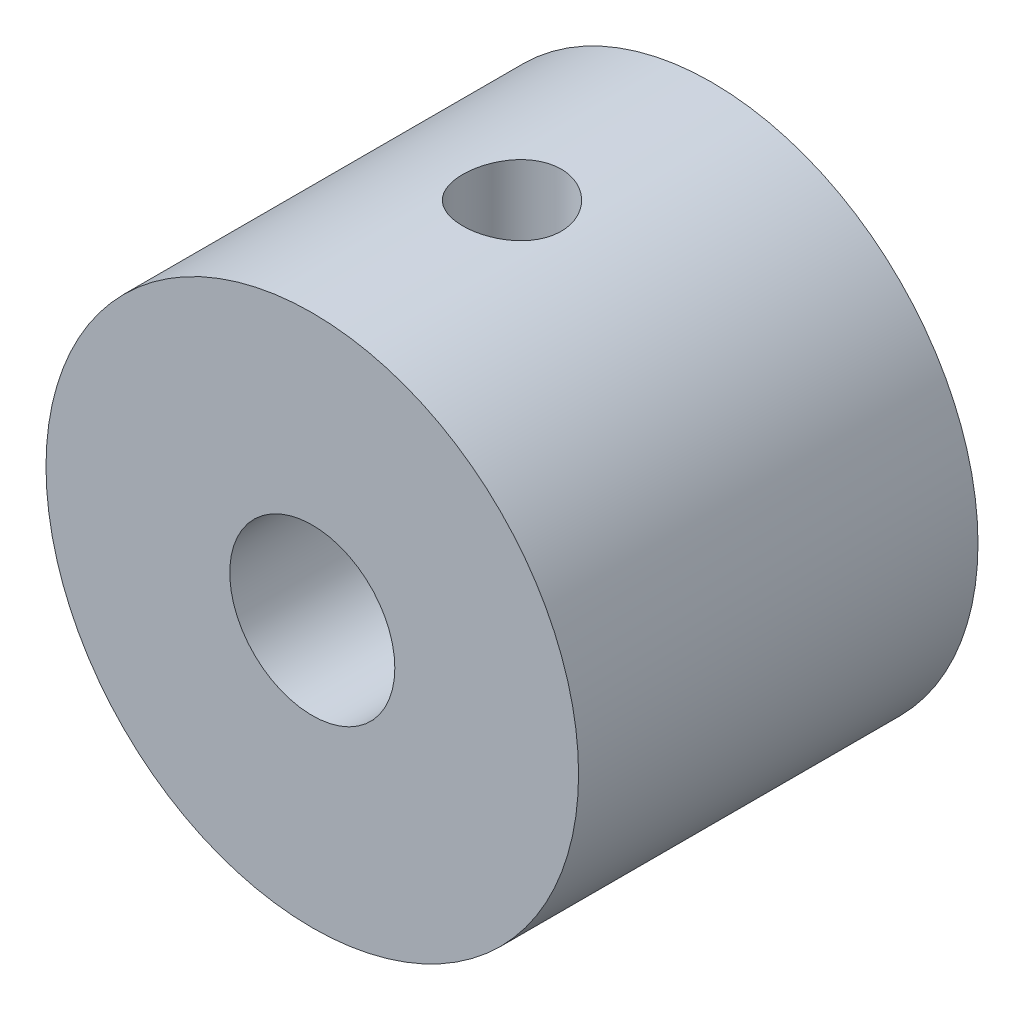
ISO-10303-21;
HEADER;
FILE_DESCRIPTION(('STEP AP214'),'2;1');
FILE_NAME('part.step','',(''),(''),'','','');
FILE_SCHEMA(('AUTOMOTIVE_DESIGN { 1 0 10303 214 1 1 1 1 }'));
ENDSEC;
DATA;
#1=APPLICATION_CONTEXT('core data for automotive mechanical design processes');
#2=APPLICATION_PROTOCOL_DEFINITION('international standard','automotive_design',2000,#1);
#3=PRODUCT_CONTEXT('',#1,'mechanical');
#4=PRODUCT('Part','Part','',(#3));
#5=PRODUCT_RELATED_PRODUCT_CATEGORY('part','',(#4));
#6=PRODUCT_DEFINITION_FORMATION('','',#4);
#7=PRODUCT_DEFINITION_CONTEXT('part definition',#1,'design');
#8=PRODUCT_DEFINITION('design','',#6,#7);
#9=PRODUCT_DEFINITION_SHAPE('','',#8);
#10=(LENGTH_UNIT() NAMED_UNIT(*) SI_UNIT(.MILLI.,.METRE.));
#11=(NAMED_UNIT(*) PLANE_ANGLE_UNIT() SI_UNIT($,.RADIAN.));
#12=(NAMED_UNIT(*) SI_UNIT($,.STERADIAN.) SOLID_ANGLE_UNIT());
#13=UNCERTAINTY_MEASURE_WITH_UNIT(LENGTH_MEASURE(1.E-05),#10,'distance_accuracy_value','');
#14=(GEOMETRIC_REPRESENTATION_CONTEXT(3) GLOBAL_UNCERTAINTY_ASSIGNED_CONTEXT((#13)) GLOBAL_UNIT_ASSIGNED_CONTEXT((#10,
#11,#12)) REPRESENTATION_CONTEXT('',''));
#15=CARTESIAN_POINT('',(0.,0.,0.));
#16=DIRECTION('',(0.,0.,1.));
#17=DIRECTION('',(1.,0.,0.));
#18=AXIS2_PLACEMENT_3D('',#15,#16,#17);
#19=CARTESIAN_POINT('',(0.,0.,15.));
#20=DIRECTION('',(0.,0.,-1.));
#21=DIRECTION('',(-1.,0.,0.));
#22=AXIS2_PLACEMENT_3D('',#19,#20,#21);
#23=CYLINDRICAL_SURFACE('',#22,10.);
#24=CARTESIAN_POINT('',(0.,0.,15.));
#25=DIRECTION('',(0.,0.,1.));
#26=DIRECTION('',(1.,0.,0.));
#27=AXIS2_PLACEMENT_3D('',#24,#25,#26);
#28=CIRCLE('',#27,10.);
#29=CARTESIAN_POINT('',(10.,0.,15.));
#30=VERTEX_POINT('',#29);
#31=EDGE_CURVE('E10',#30,#30,#28,.T.);
#32=ORIENTED_EDGE('',*,*,#31,.F.);
#33=EDGE_LOOP('',(#32));
#34=FACE_BOUND('',#33,.T.);
#35=CARTESIAN_POINT('',(0.,0.,0.));
#36=DIRECTION('',(0.,0.,1.));
#37=DIRECTION('',(1.,0.,0.));
#38=AXIS2_PLACEMENT_3D('',#35,#36,#37);
#39=CIRCLE('',#38,10.);
#40=CARTESIAN_POINT('',(10.,0.,0.));
#41=VERTEX_POINT('',#40);
#42=EDGE_CURVE('E48',#41,#41,#39,.T.);
#43=ORIENTED_EDGE('',*,*,#42,.T.);
#44=EDGE_LOOP('',(#43));
#45=FACE_BOUND('',#44,.T.);
#46=CARTESIAN_POINT('',(0.,10.,5.65));
#47=CARTESIAN_POINT('',(-0.102973767500942,9.99999814437754,5.65000396121481));
#48=CARTESIAN_POINT('',(-0.205999364269343,9.99839301990697,5.65862656276727));
#49=CARTESIAN_POINT('',(-0.409149073121758,9.99214455274753,5.6928679316607));
#50=CARTESIAN_POINT('',(-0.50927063260964,9.98749861699536,5.71850120517623));
#51=CARTESIAN_POINT('',(-0.703644751235533,9.9756884099556,5.78595358925558));
#52=CARTESIAN_POINT('',(-0.797902461405023,9.96852638674241,5.82775825436111));
#53=CARTESIAN_POINT('',(-0.978056937836697,9.9524667664763,5.92632612568955));
#54=CARTESIAN_POINT('',(-1.06395441486053,9.94356931715758,5.98308805876709));
#55=CARTESIAN_POINT('',(-1.2259618528719,9.92490532017029,6.11066270512453));
#56=CARTESIAN_POINT('',(-1.30196010842263,9.91513065935402,6.1816161012393));
#57=CARTESIAN_POINT('',(-1.44104560809233,9.8958743542123,6.33525691060604));
#58=CARTESIAN_POINT('',(-1.50413193959469,9.88639273063894,6.41794515257958));
#59=CARTESIAN_POINT('',(-1.61606530069743,9.86871722983009,6.59349511960131));
#60=CARTESIAN_POINT('',(-1.66479909447,9.86053381653359,6.68643019175173));
#61=CARTESIAN_POINT('',(-1.74591921489614,9.84649540220802,6.87934506485752));
#62=CARTESIAN_POINT('',(-1.77830691230303,9.84064020594773,6.97932427430306));
#63=CARTESIAN_POINT('',(-1.82545778290237,9.83200272690719,7.18229548977259));
#64=CARTESIAN_POINT('',(-1.8404155272159,9.82918654626154,7.28524082535124));
#65=CARTESIAN_POINT('',(-1.85288575088538,9.82684371680513,7.49221553960635));
#66=CARTESIAN_POINT('',(-1.85039975275888,9.82731678090382,7.59624482288275));
#67=CARTESIAN_POINT('',(-1.82821092133522,9.83146811709433,7.80102740333185));
#68=CARTESIAN_POINT('',(-1.80872899829315,9.83510526128641,7.90180559348345));
#69=CARTESIAN_POINT('',(-1.75344908453896,9.84511037076907,8.09863796129818));
#70=CARTESIAN_POINT('',(-1.71765041717884,9.8514784493096,8.19469194286749));
#71=CARTESIAN_POINT('',(-1.63053617300743,9.86627108014629,8.37999752620021));
#72=CARTESIAN_POINT('',(-1.57913107790427,9.87470744087739,8.46920606285033));
#73=CARTESIAN_POINT('',(-1.46232652064901,9.89267821530506,8.63781450578069));
#74=CARTESIAN_POINT('',(-1.396925674642,9.90221273754124,8.71721344089361));
#75=CARTESIAN_POINT('',(-1.25279346927696,9.92148493237727,8.86522550149164));
#76=CARTESIAN_POINT('',(-1.17387308291761,9.93122347825942,8.93365457434973));
#77=CARTESIAN_POINT('',(-1.00557542730397,9.94967197930221,9.05632940408489));
#78=CARTESIAN_POINT('',(-0.916198058419366,9.95838192466112,9.11057502581129));
#79=CARTESIAN_POINT('',(-0.729333931144301,9.97380873411794,9.20336892107791));
#80=CARTESIAN_POINT('',(-0.631837638028559,9.98052321127934,9.24189841567135));
#81=CARTESIAN_POINT('',(-0.431604995171664,9.99118402094831,9.30198219270653));
#82=CARTESIAN_POINT('',(-0.328869188274448,9.99513063959957,9.32353822990775));
#83=CARTESIAN_POINT('',(-0.122657642369728,9.99977185506567,9.34880785474743));
#84=CARTESIAN_POINT('',(-0.0192138142658465,10.000512422377,9.3527736829452));
#85=CARTESIAN_POINT('',(0.186859006065412,9.99878494252441,9.34342640494946));
#86=CARTESIAN_POINT('',(0.289488036988357,9.99631704866185,9.33011412431003));
#87=CARTESIAN_POINT('',(0.490220565537715,9.9884785460155,9.28679824376799));
#88=CARTESIAN_POINT('',(0.588352470380839,9.98313008197242,9.25692193104006));
#89=CARTESIAN_POINT('',(0.778214499245914,9.97012766508597,9.18146355022493));
#90=CARTESIAN_POINT('',(0.869944197164018,9.9624735589687,9.13588043795592));
#91=CARTESIAN_POINT('',(1.04547686385042,9.94559423372409,9.02974167290665));
#92=CARTESIAN_POINT('',(1.12918481510237,9.93635312280346,8.96903145838443));
#93=CARTESIAN_POINT('',(1.28531533096832,9.91736665587246,8.83457141023935));
#94=CARTESIAN_POINT('',(1.35773687049031,9.90762125416665,8.76082039347843));
#95=CARTESIAN_POINT('',(1.49019431675572,9.88857254624198,8.60123161299329));
#96=CARTESIAN_POINT('',(1.55005829293328,9.87927656985902,8.51525012867531));
#97=CARTESIAN_POINT('',(1.65449350417405,9.86232538613881,8.33430327140737));
#98=CARTESIAN_POINT('',(1.69906529814106,9.85467011884022,8.23933822695344));
#99=CARTESIAN_POINT('',(1.77140545970166,9.84192432437304,8.04356199576822));
#100=CARTESIAN_POINT('',(1.79925347904372,9.83682165944636,7.94278106769098));
#101=CARTESIAN_POINT('',(1.83760191623423,9.82973072940691,7.73786776570897));
#102=CARTESIAN_POINT('',(1.84810423359767,9.82774212327709,7.63373576005164));
#103=CARTESIAN_POINT('',(1.85140090250374,9.82712144275677,7.42679770087844));
#104=CARTESIAN_POINT('',(1.84446637748841,9.82843797661815,7.32399602257586));
#105=CARTESIAN_POINT('',(1.81367886703492,9.83416544699117,7.12105049290644));
#106=CARTESIAN_POINT('',(1.78982597637115,9.83857636616848,7.02090662665415));
#107=CARTESIAN_POINT('',(1.7259919299867,9.84997422761892,6.8262601345229));
#108=CARTESIAN_POINT('',(1.68603938038786,9.85695659901166,6.73174784248798));
#109=CARTESIAN_POINT('',(1.59116952647236,9.87271399612175,6.55072434665442));
#110=CARTESIAN_POINT('',(1.53625120375677,9.88148914382472,6.464213687892));
#111=CARTESIAN_POINT('',(1.41206298216248,9.90000331675751,6.30028957222133));
#112=CARTESIAN_POINT('',(1.34259548779529,9.90975453125654,6.22302716437429));
#113=CARTESIAN_POINT('',(1.19169354725332,9.92903018659891,6.08116514829167));
#114=CARTESIAN_POINT('',(1.11025635498003,9.93855457481935,6.01656845379368));
#115=CARTESIAN_POINT('',(0.936875671031765,9.95640083893824,5.90134599886731));
#116=CARTESIAN_POINT('',(0.844846667740486,9.96471149129604,5.85084712478166));
#117=CARTESIAN_POINT('',(0.653487615587092,9.97908439734253,5.76610773716441));
#118=CARTESIAN_POINT('',(0.554164580374216,9.98514877789685,5.73185183544058));
#119=CARTESIAN_POINT('',(0.378780979650357,9.99309841912857,5.6875871481404));
#120=CARTESIAN_POINT('',(0.303750536406796,9.99567199559553,5.67351586257586));
#121=CARTESIAN_POINT('',(0.152489517722104,9.99912345254983,5.65472093522481));
#122=CARTESIAN_POINT('',(0.0762589714683651,10.0000013742127,5.64999706645513));
#123=CARTESIAN_POINT('',(0.,10.,5.65));
#124=B_SPLINE_CURVE_WITH_KNOTS('',3,(#46,#47,#48,#49,#50,#51,#52,#53,#54,#55,#56,#57,#58,#59,
#60,#61,#62,#63,#64,#65,#66,#67,#68,#69,#70,#71,#72,#73,#74,#75,#76,#77,#78,#79,#80,#81,#82,#83,
#84,#85,#86,#87,#88,#89,#90,#91,#92,#93,#94,#95,#96,#97,#98,#99,#100,#101,#102,#103,#104,#105,
#106,#107,#108,#109,#110,#111,#112,#113,#114,#115,#116,#117,#118,#119,#120,#121,#122,#123),
.UNSPECIFIED.,.T.,.F.,(4,2,2,2,2,2,2,2,2,2,2,2,2,2,2,2,2,2,2,2,2,2,2,2,2,2,2,2,2,2,2,2,2,2,2,2,
2,2,4),(0.,0.308642435930629,0.617548411381326,0.926179084471102,1.23478349575572,
1.54661404003968,1.85846661694502,2.17271744097484,2.48694190813341,2.79762401675779,
3.10827900889141,3.41495532576982,3.7216443615336,4.03012690843585,4.33863997120632,
4.65188362923211,4.96513027197181,5.27875011929625,5.59233753953914,5.90141332238849,
6.21047433803256,6.5171926327777,6.82393132196844,7.13394278856437,7.44398239566323,
7.75802378080552,8.07205368703477,8.38457582329753,8.69706373322266,9.00472294455467,
9.31238043243524,9.61949366327707,9.9266277979449,10.2382405227517,10.5499248499334,
10.8643301190917,11.1784369303575,11.4070128759631,11.6355832709944),.UNSPECIFIED.);
#125=CARTESIAN_POINT('',(0.,10.,5.65));
#126=VERTEX_POINT('',#125);
#127=EDGE_CURVE('E58',#126,#126,#124,.T.);
#128=ORIENTED_EDGE('',*,*,#127,.F.);
#129=EDGE_LOOP('',(#128));
#130=FACE_BOUND('',#129,.T.);
#131=ADVANCED_FACE('F35',(#34,#45,#130),#23,.T.);
#132=CARTESIAN_POINT('',(0.,0.,15.));
#133=DIRECTION('',(0.,0.,-1.));
#134=DIRECTION('',(-1.,0.,0.));
#135=AXIS2_PLACEMENT_3D('',#132,#133,#134);
#136=CYLINDRICAL_SURFACE('',#135,3.1);
#137=CARTESIAN_POINT('',(0.,0.,0.));
#138=DIRECTION('',(0.,0.,1.));
#139=DIRECTION('',(1.,0.,0.));
#140=AXIS2_PLACEMENT_3D('',#137,#138,#139);
#141=CIRCLE('',#140,3.1);
#142=CARTESIAN_POINT('',(3.1,0.,0.));
#143=VERTEX_POINT('',#142);
#144=EDGE_CURVE('E55',#143,#143,#141,.T.);
#145=ORIENTED_EDGE('',*,*,#144,.F.);
#146=EDGE_LOOP('',(#145));
#147=FACE_BOUND('',#146,.T.);
#148=CARTESIAN_POINT('',(0.,0.,15.));
#149=DIRECTION('',(0.,0.,1.));
#150=DIRECTION('',(1.,0.,0.));
#151=AXIS2_PLACEMENT_3D('',#148,#149,#150);
#152=CIRCLE('',#151,3.1);
#153=CARTESIAN_POINT('',(3.1,0.,15.));
#154=VERTEX_POINT('',#153);
#155=EDGE_CURVE('E53',#154,#154,#152,.T.);
#156=ORIENTED_EDGE('',*,*,#155,.T.);
#157=EDGE_LOOP('',(#156));
#158=FACE_BOUND('',#157,.T.);
#159=CARTESIAN_POINT('',(0.,3.1,5.65));
#160=CARTESIAN_POINT('',(-0.0947132345870139,3.09999499847598,5.65000552343907));
#161=CARTESIAN_POINT('',(-0.189585604686496,3.09561156497168,5.65732500685834));
#162=CARTESIAN_POINT('',(-0.376481807430096,3.07849305828608,5.68623302439349));
#163=CARTESIAN_POINT('',(-0.46849780354672,3.06573682732353,5.70785770836594));
#164=CARTESIAN_POINT('',(-0.646574170463511,3.03316591680848,5.76416628386475));
#165=CARTESIAN_POINT('',(-0.73266158852329,3.01338623514344,5.79878547169075));
#166=CARTESIAN_POINT('',(-0.897537927148267,2.96845708722197,5.87970138913238));
#167=CARTESIAN_POINT('',(-0.97632878452305,2.94330905184087,5.92599500765269));
#168=CARTESIAN_POINT('',(-1.13115693032501,2.88751764849869,6.03286182379095));
#169=CARTESIAN_POINT('',(-1.20652963867187,2.85660186614829,6.09425298212399));
#170=CARTESIAN_POINT('',(-1.3465578501048,2.79333125854714,6.22773575834801));
#171=CARTESIAN_POINT('',(-1.41119948085251,2.76097463813202,6.29984100203136));
#172=CARTESIAN_POINT('',(-1.53586100941049,2.6938303732623,6.46297933314453));
#173=CARTESIAN_POINT('',(-1.59437522333545,2.65922231779246,6.55524699942709));
#174=CARTESIAN_POINT('',(-1.69484396274474,2.59634968694084,6.75033944892165));
#175=CARTESIAN_POINT('',(-1.7368251946455,2.56807491327634,6.85314686538243));
#176=CARTESIAN_POINT('',(-1.79424885410959,2.52815928507572,7.0413083587951));
#177=CARTESIAN_POINT('',(-1.813637266766,2.51415741922833,7.12495533287197));
#178=CARTESIAN_POINT('',(-1.8406213450842,2.49447452670203,7.29504980134231));
#179=CARTESIAN_POINT('',(-1.84823142990434,2.48878332649826,7.38149373902855));
#180=CARTESIAN_POINT('',(-1.85122142080804,2.48656074315108,7.55487738748269));
#181=CARTESIAN_POINT('',(-1.84657824826979,2.49004664475828,7.64181772559614));
#182=CARTESIAN_POINT('',(-1.82530668537994,2.50567762906302,7.81344159581521));
#183=CARTESIAN_POINT('',(-1.80866936358333,2.51782916455322,7.89812339734324));
#184=CARTESIAN_POINT('',(-1.76455279326819,2.54893348929105,8.06212875916449));
#185=CARTESIAN_POINT('',(-1.73720357320815,2.56780447236749,8.14150368892837));
#186=CARTESIAN_POINT('',(-1.67266015638619,2.61030612443401,8.29475163383408));
#187=CARTESIAN_POINT('',(-1.63546233233479,2.63393854631742,8.36862260897079));
#188=CARTESIAN_POINT('',(-1.54484974961771,2.68824932980257,8.52236062867517));
#189=CARTESIAN_POINT('',(-1.48974202075847,2.71943909436816,8.60104980278566));
#190=CARTESIAN_POINT('',(-1.36820488986443,2.78257321758701,8.74887348841491));
#191=CARTESIAN_POINT('',(-1.3017647861128,2.81451826469938,8.8179988555671));
#192=CARTESIAN_POINT('',(-1.14867351298057,2.88069575779706,8.95427837815984));
#193=CARTESIAN_POINT('',(-1.0605019026064,2.91464658321381,9.01987990169101));
#194=CARTESIAN_POINT('',(-0.872325276730452,2.97637871972873,9.13514452280415));
#195=CARTESIAN_POINT('',(-0.772326796917571,3.00416341412075,9.18481636753263));
#196=CARTESIAN_POINT('',(-0.569755427170623,3.04884105098225,9.26320738053645));
#197=CARTESIAN_POINT('',(-0.467756206864182,3.06631693182549,9.2930634123499));
#198=CARTESIAN_POINT('',(-0.258981241667826,3.09094323696205,9.33486337290317));
#199=CARTESIAN_POINT('',(-0.152211253869935,3.09810577743849,9.34682832084832));
#200=CARTESIAN_POINT('',(0.047517129489391,3.10102613582732,9.35171727365221));
#201=CARTESIAN_POINT('',(0.140407102996038,3.09818486478921,9.34698007378025));
#202=CARTESIAN_POINT('',(0.323830515774661,3.08441033738725,9.32378053318367));
#203=CARTESIAN_POINT('',(0.414363991005797,3.07347720457679,9.30531840202289));
#204=CARTESIAN_POINT('',(0.588604579297929,3.04486059891066,9.25615009389004));
#205=CARTESIAN_POINT('',(0.672419666801867,3.0273351078665,9.22572977307745));
#206=CARTESIAN_POINT('',(0.83374731406777,2.98693633841595,9.15383543988078));
#207=CARTESIAN_POINT('',(0.9112585984148,2.96406198141199,9.11235919783637));
#208=CARTESIAN_POINT('',(1.06648651282774,2.91204127703509,9.01471722251934));
#209=CARTESIAN_POINT('',(1.14338705482156,2.88249013913804,8.9574727390845));
#210=CARTESIAN_POINT('',(1.28707583932675,2.82126740775871,8.83230326436883));
#211=CARTESIAN_POINT('',(1.35385211361277,2.78959336750514,8.76436582291132));
#212=CARTESIAN_POINT('',(1.48420331300463,2.72271262289458,8.609574220654));
#213=CARTESIAN_POINT('',(1.54626893146403,2.68757391979496,8.52141140106956));
#214=CARTESIAN_POINT('',(1.65472936758791,2.6221915991433,8.33428522007982));
#215=CARTESIAN_POINT('',(1.70114130332587,2.59194265338082,8.23533381430616));
#216=CARTESIAN_POINT('',(1.76815831440978,2.54654465018254,8.05095007575635));
#217=CARTESIAN_POINT('',(1.79217286100589,2.52954510541722,7.96721727188742));
#218=CARTESIAN_POINT('',(1.82824546274089,2.50360213350053,7.79604625795834));
#219=CARTESIAN_POINT('',(1.84031977648642,2.49464775304868,7.70861325608068));
#220=CARTESIAN_POINT('',(1.85183987952252,2.48611093655015,7.5321296413818));
#221=CARTESIAN_POINT('',(1.85124098981974,2.48656165782591,7.44307441183545));
#222=CARTESIAN_POINT('',(1.83734261767086,2.49684590751462,7.26649318799078));
#223=CARTESIAN_POINT('',(1.82403601849356,2.50668469354702,7.1789680785803));
#224=CARTESIAN_POINT('',(1.78637679344244,2.5336448327387,7.01175242854769));
#225=CARTESIAN_POINT('',(1.76254041878809,2.55042372725825,6.93188657884061));
#226=CARTESIAN_POINT('',(1.7049591926897,2.58926949819592,6.77720426458185));
#227=CARTESIAN_POINT('',(1.67121062082016,2.61133835956735,6.70238970896444));
#228=CARTESIAN_POINT('',(1.58878753808649,2.66241344161458,6.54759035445402));
#229=CARTESIAN_POINT('',(1.53861451760062,2.69196463957654,6.46858480904812));
#230=CARTESIAN_POINT('',(1.42730727810138,2.75260218582496,6.31933293200949));
#231=CARTESIAN_POINT('',(1.36616408414169,2.78368977586585,6.24909385280554));
#232=CARTESIAN_POINT('',(1.22321755246571,2.84971352086646,6.10793094894824));
#233=CARTESIAN_POINT('',(1.1396753134026,2.88447714320048,6.03866868638908));
#234=CARTESIAN_POINT('',(0.960393251811544,2.9490219805016,5.9150693380312));
#235=CARTESIAN_POINT('',(0.864649408286726,2.97880154547189,5.86073719111514));
#236=CARTESIAN_POINT('',(0.666445481692726,3.02917355731054,5.77091514094764));
#237=CARTESIAN_POINT('',(0.564326429803536,3.05004502166506,5.73484512363629));
#238=CARTESIAN_POINT('',(0.40678724554142,3.07365634158657,5.6944605844974));
#239=CARTESIAN_POINT('',(0.353606402048807,3.08024120147616,5.68329044308883));
#240=CARTESIAN_POINT('',(0.246220654963905,3.09067506128372,5.66565388530079));
#241=CARTESIAN_POINT('',(0.192016656271794,3.09452637220751,5.6591834955337));
#242=CARTESIAN_POINT('',(0.114715340503425,3.09796166199516,5.65341726697156));
#243=CARTESIAN_POINT('',(0.0917988506499488,3.09872518460287,5.65213670842156));
#244=CARTESIAN_POINT('',(0.0459246937856559,3.09974496741079,5.65042739282763));
#245=CARTESIAN_POINT('',(0.0229670255937319,3.10000121282026,5.64999866062048));
#246=CARTESIAN_POINT('',(0.,3.1,5.65));
#247=B_SPLINE_CURVE_WITH_KNOTS('',3,(#159,#160,#161,#162,#163,#164,#165,#166,#167,#168,#169,
#170,#171,#172,#173,#174,#175,#176,#177,#178,#179,#180,#181,#182,#183,#184,#185,#186,#187,#188,
#189,#190,#191,#192,#193,#194,#195,#196,#197,#198,#199,#200,#201,#202,#203,#204,#205,#206,#207,
#208,#209,#210,#211,#212,#213,#214,#215,#216,#217,#218,#219,#220,#221,#222,#223,#224,#225,#226,
#227,#228,#229,#230,#231,#232,#233,#234,#235,#236,#237,#238,#239,#240,#241,#242,#243,#244,#245,
#246),.UNSPECIFIED.,.T.,.F.,(4,2,2,2,2,2,2,2,2,2,2,2,2,2,2,2,2,2,2,2,2,2,2,2,2,2,2,2,2,2,2,2,2,
2,2,2,2,2,2,2,2,2,2,4),(0.,0.284045724778324,0.568812001428186,0.852178752612636,
1.1354700696177,1.44029562001197,1.74551220833155,2.08766054730658,2.42925391026576,
2.68914194394801,2.94871156748081,3.20877043093829,3.46902314755911,3.72621004484835,
3.98349179742782,4.28533987621912,4.58747459933336,4.9307868900917,5.27391034055317,
5.59508921364128,5.91589045485958,6.19366073619761,6.47142677639171,6.74292144201415,
7.01447090175639,7.31424583909761,7.6143724324891,7.95299606717596,8.29124819042132,
8.5564034735105,8.82119720451022,9.08692461278672,9.35280092438997,9.60688155757342,
9.86105767904296,10.1543935429242,10.4479704949714,10.7881545657828,11.1284510343953,
11.4571260455128,11.6211144136665,11.7849639765709,11.8538402561719,11.9227185439764),.UNSPECIFIED.);
#248=CARTESIAN_POINT('',(0.,3.1,5.65));
#249=VERTEX_POINT('',#248);
#250=EDGE_CURVE('E39',#249,#249,#247,.T.);
#251=ORIENTED_EDGE('',*,*,#250,.T.);
#252=EDGE_LOOP('',(#251));
#253=FACE_BOUND('',#252,.T.);
#254=ADVANCED_FACE('F70',(#147,#158,#253),#136,.F.);
#255=CARTESIAN_POINT('',(0.,0.,15.));
#256=DIRECTION('',(0.,0.,1.));
#257=DIRECTION('',(1.,0.,0.));
#258=AXIS2_PLACEMENT_3D('',#255,#256,#257);
#259=PLANE('',#258);
#260=ORIENTED_EDGE('',*,*,#31,.T.);
#261=EDGE_LOOP('',(#260));
#262=FACE_BOUND('',#261,.T.);
#263=ORIENTED_EDGE('',*,*,#155,.F.);
#264=EDGE_LOOP('',(#263));
#265=FACE_BOUND('',#264,.T.);
#266=ADVANCED_FACE('F75',(#262,#265),#259,.T.);
#267=CARTESIAN_POINT('',(0.,0.,0.));
#268=DIRECTION('',(0.,0.,1.));
#269=DIRECTION('',(1.,0.,0.));
#270=AXIS2_PLACEMENT_3D('',#267,#268,#269);
#271=PLANE('',#270);
#272=ORIENTED_EDGE('',*,*,#42,.F.);
#273=EDGE_LOOP('',(#272));
#274=FACE_BOUND('',#273,.T.);
#275=ORIENTED_EDGE('',*,*,#144,.T.);
#276=EDGE_LOOP('',(#275));
#277=FACE_BOUND('',#276,.T.);
#278=ADVANCED_FACE('F68',(#274,#277),#271,.F.);
#279=CARTESIAN_POINT('',(0.,10.,7.5));
#280=DIRECTION('',(0.,-1.,0.));
#281=DIRECTION('',(0.,0.,-1.));
#282=AXIS2_PLACEMENT_3D('',#279,#280,#281);
#283=CYLINDRICAL_SURFACE('',#282,1.85);
#284=ORIENTED_EDGE('',*,*,#250,.F.);
#285=EDGE_LOOP('',(#284));
#286=FACE_BOUND('',#285,.T.);
#287=ORIENTED_EDGE('',*,*,#127,.T.);
#288=EDGE_LOOP('',(#287));
#289=FACE_BOUND('',#288,.T.);
#290=ADVANCED_FACE('F65',(#286,#289),#283,.F.);
#291=CLOSED_SHELL('',(#131,#254,#266,#278,#290));
#292=MANIFOLD_SOLID_BREP('B2',#291);
#293=ADVANCED_BREP_SHAPE_REPRESENTATION('',(#18,#292),#14);
#294=SHAPE_DEFINITION_REPRESENTATION(#9,#293);
ENDSEC;
END-ISO-10303-21;
